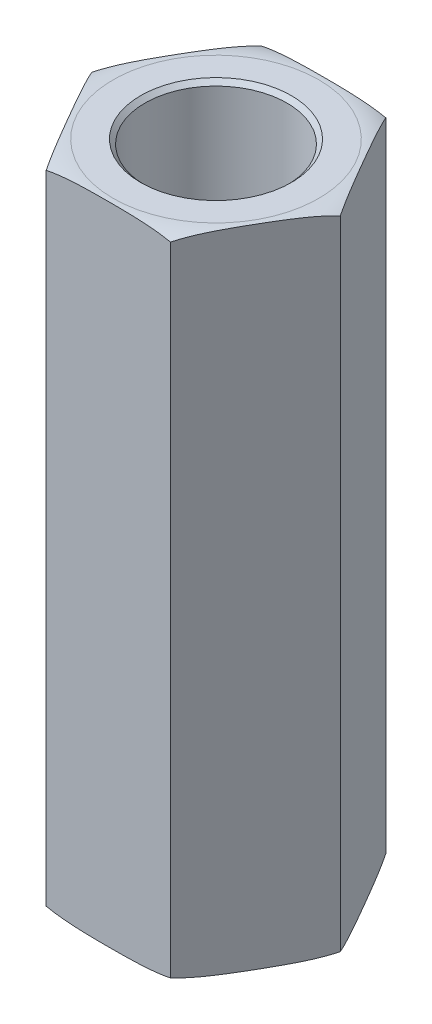
ISO-10303-21;
HEADER;
FILE_DESCRIPTION(('STEP AP214'),'2;1');
FILE_NAME('part.step','',(''),(''),'','','');
FILE_SCHEMA(('AUTOMOTIVE_DESIGN { 1 0 10303 214 1 1 1 1 }'));
ENDSEC;
DATA;
#1=APPLICATION_CONTEXT('core data for automotive mechanical design processes');
#2=APPLICATION_PROTOCOL_DEFINITION('international standard','automotive_design',2000,#1);
#3=PRODUCT_CONTEXT('',#1,'mechanical');
#4=PRODUCT('Part','Part','',(#3));
#5=PRODUCT_RELATED_PRODUCT_CATEGORY('part','',(#4));
#6=PRODUCT_DEFINITION_FORMATION('','',#4);
#7=PRODUCT_DEFINITION_CONTEXT('part definition',#1,'design');
#8=PRODUCT_DEFINITION('design','',#6,#7);
#9=PRODUCT_DEFINITION_SHAPE('','',#8);
#10=(LENGTH_UNIT() NAMED_UNIT(*) SI_UNIT(.MILLI.,.METRE.));
#11=(NAMED_UNIT(*) PLANE_ANGLE_UNIT() SI_UNIT($,.RADIAN.));
#12=(NAMED_UNIT(*) SI_UNIT($,.STERADIAN.) SOLID_ANGLE_UNIT());
#13=UNCERTAINTY_MEASURE_WITH_UNIT(LENGTH_MEASURE(1.E-05),#10,'distance_accuracy_value','');
#14=(GEOMETRIC_REPRESENTATION_CONTEXT(3) GLOBAL_UNCERTAINTY_ASSIGNED_CONTEXT((#13)) GLOBAL_UNIT_ASSIGNED_CONTEXT((#10,
#11,#12)) REPRESENTATION_CONTEXT('',''));
#15=CARTESIAN_POINT('',(0.,0.,0.));
#16=DIRECTION('',(0.,0.,1.));
#17=DIRECTION('',(1.,0.,0.));
#18=AXIS2_PLACEMENT_3D('',#15,#16,#17);
#19=CARTESIAN_POINT('',(3.66617420935412,9.525,0.));
#20=DIRECTION('',(-0.866025403784439,0.,0.5));
#21=DIRECTION('',(0.5,0.,0.866025403784439));
#22=AXIS2_PLACEMENT_3D('',#19,#20,#21);
#23=PLANE('',#22);
#24=DIRECTION('',(0.,1.,0.));
#25=VECTOR('',#24,1.);
#26=CARTESIAN_POINT('',(1.83308710467705,9.525,-3.175));
#27=LINE('',#26,#25);
#28=CARTESIAN_POINT('',(1.83308710467705,-9.398,-3.175));
#29=VERTEX_POINT('',#28);
#30=CARTESIAN_POINT('',(1.83308710467706,9.398,-3.175));
#31=VERTEX_POINT('',#30);
#32=EDGE_CURVE('E144',#29,#31,#27,.T.);
#33=ORIENTED_EDGE('',*,*,#32,.T.);
#34=CARTESIAN_POINT('',(3.66617420935412,9.398,0.));
#35=CARTESIAN_POINT('',(3.62797961467395,9.41390141489969,-0.0661549785605542));
#36=CARTESIAN_POINT('',(3.58956810864157,9.4274886076105,-0.132685658603869));
#37=CARTESIAN_POINT('',(3.51249051795711,9.45081619794021,-0.266187961794349));
#38=CARTESIAN_POINT('',(3.47382473049847,9.46056047713974,-0.333159070187379));
#39=CARTESIAN_POINT('',(3.39641631867874,9.4769966530451,-0.467234372392366));
#40=CARTESIAN_POINT('',(3.35767399633313,9.48369453286691,-0.534338043098168));
#41=CARTESIAN_POINT('',(3.28009834620114,9.4947767572932,-0.668703010556962));
#42=CARTESIAN_POINT('',(3.24126499587772,9.49916045047396,-0.735964346345247));
#43=CARTESIAN_POINT('',(3.16354065964316,9.50624030042628,-0.870586845688074));
#44=CARTESIAN_POINT('',(3.12464965374477,9.50893552375912,-0.937948043861543));
#45=CARTESIAN_POINT('',(3.04685144594594,9.51315319837134,-1.07269849250692));
#46=CARTESIAN_POINT('',(3.00794424351971,9.51467560802717,-1.14008774388952));
#47=CARTESIAN_POINT('',(2.93051517598875,9.51692270588903,-1.27419882283583));
#48=CARTESIAN_POINT('',(2.89199336248936,9.51765524681809,-1.34092056101645));
#49=CARTESIAN_POINT('',(2.81494778346146,9.51857673025742,-1.47436741839135));
#50=CARTESIAN_POINT('',(2.77642401791441,9.51876566589491,-1.5410925376177));
#51=CARTESIAN_POINT('',(2.69935964431015,9.51866599668056,-1.67457194815376));
#52=CARTESIAN_POINT('',(2.66081903631824,9.51837718117656,-1.74132623935034));
#53=CARTESIAN_POINT('',(2.58373908085332,9.517221986219,-1.87483263846072));
#54=CARTESIAN_POINT('',(2.54519973341248,9.51635559703857,-1.94158474631881));
#55=CARTESIAN_POINT('',(2.46812969629774,9.51378619406564,-2.07507396634277));
#56=CARTESIAN_POINT('',(2.42959900625968,9.51208322716166,-2.14181107913937));
#57=CARTESIAN_POINT('',(2.35255651340912,9.50743872297261,-2.27525259109831));
#58=CARTESIAN_POINT('',(2.31404470975446,9.50449724713581,-2.34195699171929));
#59=CARTESIAN_POINT('',(2.25084206239948,9.49821741247489,-2.45142718811098));
#60=CARTESIAN_POINT('',(2.22613849337013,9.49539801104633,-2.4942150247981));
#61=CARTESIAN_POINT('',(2.1767694527223,9.48886967943037,-2.57972471152106));
#62=CARTESIAN_POINT('',(2.15210397034186,9.48516108091391,-2.62244658019719));
#63=CARTESIAN_POINT('',(2.10282753811698,9.4766802711497,-2.70779586442641));
#64=CARTESIAN_POINT('',(2.07821657107531,9.47190846570085,-2.75042330976598));
#65=CARTESIAN_POINT('',(2.02900094683551,9.4610987712516,-2.83566727147553));
#66=CARTESIAN_POINT('',(2.00439646085464,9.45505773130843,-2.87828349128851));
#67=CARTESIAN_POINT('',(1.95527325900934,9.44151383541612,-2.96336737271503));
#68=CARTESIAN_POINT('',(1.93075459617615,9.43401019780297,-3.00583494247578));
#69=CARTESIAN_POINT('',(1.88182157373171,9.41732035070844,-3.09058942351744));
#70=CARTESIAN_POINT('',(1.85740744053269,9.40813149780328,-3.1328759426409));
#71=CARTESIAN_POINT('',(1.83308710467706,9.398,-3.175));
#72=B_SPLINE_CURVE_WITH_KNOTS('',3,(#34,#35,#36,#37,#38,#39,#40,#41,#42,#43,#44,#45,#46,#47,#48,
#49,#50,#51,#52,#53,#54,#55,#56,#57,#58,#59,#60,#61,#62,#63,#64,#65,#66,#67,#68,#69,#70,#71),
.UNSPECIFIED.,.F.,.F.,(4,2,2,2,2,2,2,2,2,2,2,2,2,2,2,2,2,2,4),(0.,0.233977307817935,
0.467717675040681,0.70099697355748,0.934341903229723,1.16781571967236,1.40129782179821,
1.63243665809665,1.86357841666612,2.09482211846288,2.32606971471488,2.5573043514739,
2.78852751694405,2.93698369265081,3.08538458004469,3.23372892334581,3.3824459854661,
3.53124274626083,3.68027493713586),.UNSPECIFIED.);
#73=CARTESIAN_POINT('',(3.66617420935412,9.398,0.));
#74=VERTEX_POINT('',#73);
#75=EDGE_CURVE('E96',#74,#31,#72,.T.);
#76=ORIENTED_EDGE('',*,*,#75,.F.);
#77=DIRECTION('',(0.,1.,0.));
#78=VECTOR('',#77,1.);
#79=CARTESIAN_POINT('',(3.66617420935412,9.525,0.));
#80=LINE('',#79,#78);
#81=CARTESIAN_POINT('',(3.66617420935412,-9.398,0.));
#82=VERTEX_POINT('',#81);
#83=EDGE_CURVE('E146',#74,#82,#80,.F.);
#84=ORIENTED_EDGE('',*,*,#83,.T.);
#85=CARTESIAN_POINT('',(1.83308710467705,-9.398,-3.17500000000001));
#86=CARTESIAN_POINT('',(1.87128169935722,-9.41390141489968,-3.10884502143945));
#87=CARTESIAN_POINT('',(1.9096932053896,-9.4274886076105,-3.04231434139614));
#88=CARTESIAN_POINT('',(1.98677079607406,-9.4508161979402,-2.90881203820566));
#89=CARTESIAN_POINT('',(2.0254365835327,-9.46056047713973,-2.84184092981263));
#90=CARTESIAN_POINT('',(2.10284499535243,-9.47699665304509,-2.70776562760765));
#91=CARTESIAN_POINT('',(2.14158731769803,-9.48369453286691,-2.64066195690184));
#92=CARTESIAN_POINT('',(2.21916296783002,-9.49477675729319,-2.50629698944305));
#93=CARTESIAN_POINT('',(2.25799631815344,-9.49916045047396,-2.43903565365477));
#94=CARTESIAN_POINT('',(2.335720654388,-9.50624030042628,-2.30441315431194));
#95=CARTESIAN_POINT('',(2.37461166028639,-9.50893552375912,-2.23705195613848));
#96=CARTESIAN_POINT('',(2.45240986808522,-9.51315319837134,-2.10230150749311));
#97=CARTESIAN_POINT('',(2.49131707051145,-9.51467560802717,-2.0349122561105));
#98=CARTESIAN_POINT('',(2.56874613804241,-9.51692270588903,-1.9008011771642));
#99=CARTESIAN_POINT('',(2.6072679515418,-9.51765524681809,-1.83407943898357));
#100=CARTESIAN_POINT('',(2.6843135305697,-9.51857673025742,-1.70063258160867));
#101=CARTESIAN_POINT('',(2.72283729611674,-9.51876566589491,-1.63390746238233));
#102=CARTESIAN_POINT('',(2.79990166972101,-9.51866599668056,-1.50042805184627));
#103=CARTESIAN_POINT('',(2.83844227771292,-9.51837718117656,-1.43367376064969));
#104=CARTESIAN_POINT('',(2.91552223317783,-9.517221986219,-1.30016736153931));
#105=CARTESIAN_POINT('',(2.95406158061867,-9.51635559703857,-1.23341525368122));
#106=CARTESIAN_POINT('',(3.03113161773342,-9.51378619406564,-1.09992603365727));
#107=CARTESIAN_POINT('',(3.06966230777147,-9.51208322716166,-1.03318892086067));
#108=CARTESIAN_POINT('',(3.14670480062203,-9.50743872297261,-0.899747408901733));
#109=CARTESIAN_POINT('',(3.18521660427669,-9.50449724713582,-0.83304300828075));
#110=CARTESIAN_POINT('',(3.24841925163167,-9.49821741247489,-0.723572811889063));
#111=CARTESIAN_POINT('',(3.27312282066102,-9.49539801104633,-0.680784975201942));
#112=CARTESIAN_POINT('',(3.32249186130885,-9.48886967943037,-0.595275288478971));
#113=CARTESIAN_POINT('',(3.3471573436893,-9.48516108091391,-0.552553419802841));
#114=CARTESIAN_POINT('',(3.39643377591418,-9.4766802711497,-0.46720413557362));
#115=CARTESIAN_POINT('',(3.42104474295585,-9.47190846570085,-0.424576690234039));
#116=CARTESIAN_POINT('',(3.47026036719565,-9.4610987712516,-0.339332728524487));
#117=CARTESIAN_POINT('',(3.49486485317652,-9.45505773130843,-0.296716508711511));
#118=CARTESIAN_POINT('',(3.54398805502183,-9.44151383541613,-0.211632627284978));
#119=CARTESIAN_POINT('',(3.56850671785502,-9.43401019780297,-0.169165057524231));
#120=CARTESIAN_POINT('',(3.61743974029946,-9.41732035070845,-0.08441057648256));
#121=CARTESIAN_POINT('',(3.64185387349848,-9.40813149780329,-0.0421240573591054));
#122=CARTESIAN_POINT('',(3.66617420935412,-9.398,0.));
#123=B_SPLINE_CURVE_WITH_KNOTS('',3,(#85,#86,#87,#88,#89,#90,#91,#92,#93,#94,#95,#96,#97,#98,
#99,#100,#101,#102,#103,#104,#105,#106,#107,#108,#109,#110,#111,#112,#113,#114,#115,#116,#117,
#118,#119,#120,#121,#122),.UNSPECIFIED.,.F.,.F.,(4,2,2,2,2,2,2,2,2,2,2,2,2,2,2,2,2,2,4),(0.,
0.233977307817932,0.467717675040674,0.700996973557469,0.934341903229708,1.16781571967234,
1.40129782179818,1.63243665809662,1.86357841666608,2.09482211846285,2.32606971471484,
2.55730435147386,2.78852751694401,2.93698369265077,3.08538458004466,3.23372892334579,
3.38244598546609,3.53124274626083,3.68027493713586),.UNSPECIFIED.);
#124=EDGE_CURVE('E224',#29,#82,#123,.T.);
#125=ORIENTED_EDGE('',*,*,#124,.F.);
#126=EDGE_LOOP('',(#33,#76,#84,#125));
#127=FACE_BOUND('',#126,.T.);
#128=ADVANCED_FACE('F16',(#127),#23,.F.);
#129=CARTESIAN_POINT('',(1.83308710467706,9.525,3.17499999999999));
#130=DIRECTION('',(-0.866025403784439,0.,-0.5));
#131=DIRECTION('',(-0.5,0.,0.866025403784439));
#132=AXIS2_PLACEMENT_3D('',#129,#130,#131);
#133=PLANE('',#132);
#134=ORIENTED_EDGE('',*,*,#83,.F.);
#135=CARTESIAN_POINT('',(1.83308710467706,9.398,3.17499999999999));
#136=CARTESIAN_POINT('',(1.87128169935724,9.41390141489969,3.10884502143943));
#137=CARTESIAN_POINT('',(1.90969320538961,9.4274886076105,3.04231434139612));
#138=CARTESIAN_POINT('',(1.98677079607407,9.45081619794021,2.90881203820564));
#139=CARTESIAN_POINT('',(2.02543658353271,9.46056047713974,2.84184092981261));
#140=CARTESIAN_POINT('',(2.10284499535245,9.4769966530451,2.70776562760762));
#141=CARTESIAN_POINT('',(2.14158731769805,9.48369453286691,2.64066195690182));
#142=CARTESIAN_POINT('',(2.21916296783004,9.4947767572932,2.50629698944302));
#143=CARTESIAN_POINT('',(2.25799631815346,9.49916045047396,2.43903565365474));
#144=CARTESIAN_POINT('',(2.33572065438802,9.50624030042628,2.30441315431191));
#145=CARTESIAN_POINT('',(2.37461166028641,9.50893552375912,2.23705195613844));
#146=CARTESIAN_POINT('',(2.45240986808524,9.51315319837134,2.10230150749307));
#147=CARTESIAN_POINT('',(2.49131707051148,9.51467560802717,2.03491225611046));
#148=CARTESIAN_POINT('',(2.56874613804244,9.51692270588903,1.90080117716416));
#149=CARTESIAN_POINT('',(2.60726795154182,9.51765524681809,1.83407943898353));
#150=CARTESIAN_POINT('',(2.68431353056973,9.51857673025742,1.70063258160863));
#151=CARTESIAN_POINT('',(2.72283729611677,9.51876566589491,1.63390746238228));
#152=CARTESIAN_POINT('',(2.79990166972104,9.51866599668056,1.50042805184622));
#153=CARTESIAN_POINT('',(2.83844227771295,9.51837718117656,1.43367376064964));
#154=CARTESIAN_POINT('',(2.91552223317786,9.517221986219,1.30016736153926));
#155=CARTESIAN_POINT('',(2.95406158061871,9.51635559703857,1.23341525368117));
#156=CARTESIAN_POINT('',(3.03113161773345,9.51378619406564,1.09992603365721));
#157=CARTESIAN_POINT('',(3.06966230777151,9.51208322716166,1.03318892086061));
#158=CARTESIAN_POINT('',(3.14670480062207,9.50743872297261,0.899747408901672));
#159=CARTESIAN_POINT('',(3.18521660427673,9.50449724713581,0.833043008280688));
#160=CARTESIAN_POINT('',(3.24841925163171,9.49821741247489,0.723572811889004));
#161=CARTESIAN_POINT('',(3.27312282066106,9.49539801104633,0.680784975201887));
#162=CARTESIAN_POINT('',(3.32249186130888,9.48886967943037,0.595275288478923));
#163=CARTESIAN_POINT('',(3.34715734368933,9.48516108091391,0.552553419802797));
#164=CARTESIAN_POINT('',(3.3964337759142,9.4766802711497,0.467204135573584));
#165=CARTESIAN_POINT('',(3.42104474295588,9.47190846570085,0.424576690234007));
#166=CARTESIAN_POINT('',(3.47026036719567,9.4610987712516,0.339332728524462));
#167=CARTESIAN_POINT('',(3.49486485317654,9.45505773130843,0.296716508711489));
#168=CARTESIAN_POINT('',(3.54398805502184,9.44151383541612,0.211632627284964));
#169=CARTESIAN_POINT('',(3.56850671785503,9.43401019780297,0.169165057524221));
#170=CARTESIAN_POINT('',(3.61743974029946,9.41732035070844,0.0844105764825579));
#171=CARTESIAN_POINT('',(3.64185387349848,9.40813149780328,0.042124057359107));
#172=CARTESIAN_POINT('',(3.66617420935412,9.398,0.));
#173=B_SPLINE_CURVE_WITH_KNOTS('',3,(#135,#136,#137,#138,#139,#140,#141,#142,#143,#144,#145,
#146,#147,#148,#149,#150,#151,#152,#153,#154,#155,#156,#157,#158,#159,#160,#161,#162,#163,#164,
#165,#166,#167,#168,#169,#170,#171,#172),.UNSPECIFIED.,.F.,.F.,(4,2,2,2,2,2,2,2,2,2,2,2,2,2,2,2,
2,2,4),(0.,0.233977307817936,0.467717675040682,0.700996973557482,0.934341903229727,
1.16781571967237,1.40129782179821,1.63243665809666,1.86357841666612,2.09482211846289,
2.32606971471489,2.55730435147391,2.78852751694406,2.93698369265081,3.08538458004469,
3.23372892334581,3.3824459854661,3.53124274626082,3.68027493713584),.UNSPECIFIED.);
#174=CARTESIAN_POINT('',(1.83308710467707,9.398,3.17499999999999));
#175=VERTEX_POINT('',#174);
#176=EDGE_CURVE('E217',#175,#74,#173,.T.);
#177=ORIENTED_EDGE('',*,*,#176,.F.);
#178=DIRECTION('',(0.,1.,0.));
#179=VECTOR('',#178,1.);
#180=CARTESIAN_POINT('',(1.83308710467707,9.525,3.17499999999999));
#181=LINE('',#180,#179);
#182=CARTESIAN_POINT('',(1.83308710467706,-9.398,3.17499999999999));
#183=VERTEX_POINT('',#182);
#184=EDGE_CURVE('E141',#175,#183,#181,.F.);
#185=ORIENTED_EDGE('',*,*,#184,.T.);
#186=CARTESIAN_POINT('',(3.66617420935412,-9.398,0.));
#187=CARTESIAN_POINT('',(3.62797961467395,-9.41390141489969,0.0661549785605599));
#188=CARTESIAN_POINT('',(3.58956810864157,-9.4274886076105,0.132685658603875));
#189=CARTESIAN_POINT('',(3.51249051795711,-9.45081619794021,0.266187961794355));
#190=CARTESIAN_POINT('',(3.47382473049847,-9.46056047713974,0.333159070187385));
#191=CARTESIAN_POINT('',(3.39641631867874,-9.4769966530451,0.467234372392373));
#192=CARTESIAN_POINT('',(3.35767399633313,-9.48369453286691,0.534338043098174));
#193=CARTESIAN_POINT('',(3.28009834620114,-9.4947767572932,0.668703010556968));
#194=CARTESIAN_POINT('',(3.24126499587772,-9.49916045047396,0.735964346345254));
#195=CARTESIAN_POINT('',(3.16354065964316,-9.50624030042628,0.87058684568808));
#196=CARTESIAN_POINT('',(3.12464965374477,-9.50893552375912,0.93794804386155));
#197=CARTESIAN_POINT('',(3.04685144594594,-9.51315319837134,1.07269849250692));
#198=CARTESIAN_POINT('',(3.00794424351971,-9.51467560802717,1.14008774388953));
#199=CARTESIAN_POINT('',(2.93051517598875,-9.51692270588903,1.27419882283583));
#200=CARTESIAN_POINT('',(2.89199336248936,-9.51765524681809,1.34092056101646));
#201=CARTESIAN_POINT('',(2.81494778346145,-9.51857673025742,1.47436741839136));
#202=CARTESIAN_POINT('',(2.77642401791441,-9.51876566589491,1.54109253761771));
#203=CARTESIAN_POINT('',(2.69935964431015,-9.51866599668056,1.67457194815377));
#204=CARTESIAN_POINT('',(2.66081903631824,-9.51837718117656,1.74132623935035));
#205=CARTESIAN_POINT('',(2.58373908085332,-9.517221986219,1.87483263846073));
#206=CARTESIAN_POINT('',(2.54519973341248,-9.51635559703857,1.94158474631882));
#207=CARTESIAN_POINT('',(2.46812969629773,-9.51378619406564,2.07507396634278));
#208=CARTESIAN_POINT('',(2.42959900625968,-9.51208322716166,2.14181107913938));
#209=CARTESIAN_POINT('',(2.35255651340911,-9.50743872297261,2.27525259109832));
#210=CARTESIAN_POINT('',(2.31404470975446,-9.50449724713581,2.3419569917193));
#211=CARTESIAN_POINT('',(2.25084206239948,-9.49821741247489,2.45142718811099));
#212=CARTESIAN_POINT('',(2.22613849337013,-9.49539801104633,2.4942150247981));
#213=CARTESIAN_POINT('',(2.1767694527223,-9.48886967943037,2.57972471152107));
#214=CARTESIAN_POINT('',(2.15210397034186,-9.48516108091391,2.62244658019719));
#215=CARTESIAN_POINT('',(2.10282753811698,-9.4766802711497,2.70779586442641));
#216=CARTESIAN_POINT('',(2.07821657107531,-9.47190846570085,2.75042330976598));
#217=CARTESIAN_POINT('',(2.02900094683551,-9.4610987712516,2.83566727147553));
#218=CARTESIAN_POINT('',(2.00439646085465,-9.45505773130843,2.8782834912885));
#219=CARTESIAN_POINT('',(1.95527325900934,-9.44151383541612,2.96336737271503));
#220=CARTESIAN_POINT('',(1.93075459617615,-9.43401019780296,3.00583494247577));
#221=CARTESIAN_POINT('',(1.88182157373172,-9.41732035070844,3.09058942351744));
#222=CARTESIAN_POINT('',(1.8574074405327,-9.40813149780329,3.13287594264089));
#223=CARTESIAN_POINT('',(1.83308710467706,-9.398,3.17499999999999));
#224=B_SPLINE_CURVE_WITH_KNOTS('',3,(#186,#187,#188,#189,#190,#191,#192,#193,#194,#195,#196,
#197,#198,#199,#200,#201,#202,#203,#204,#205,#206,#207,#208,#209,#210,#211,#212,#213,#214,#215,
#216,#217,#218,#219,#220,#221,#222,#223),.UNSPECIFIED.,.F.,.F.,(4,2,2,2,2,2,2,2,2,2,2,2,2,2,2,2,
2,2,4),(0.,0.233977307817936,0.467717675040682,0.700996973557481,0.934341903229725,
1.16781571967236,1.40129782179821,1.63243665809665,1.86357841666612,2.09482211846289,
2.32606971471488,2.55730435147391,2.78852751694405,2.93698369265081,3.08538458004468,
3.2337289233458,3.38244598546609,3.53124274626082,3.68027493713584),.UNSPECIFIED.);
#225=EDGE_CURVE('E246',#82,#183,#224,.T.);
#226=ORIENTED_EDGE('',*,*,#225,.F.);
#227=EDGE_LOOP('',(#134,#177,#185,#226));
#228=FACE_BOUND('',#227,.T.);
#229=ADVANCED_FACE('F221',(#228),#133,.F.);
#230=CARTESIAN_POINT('',(1.83308710467706,9.525,-3.175));
#231=DIRECTION('',(0.,0.,1.));
#232=DIRECTION('',(1.,0.,0.));
#233=AXIS2_PLACEMENT_3D('',#230,#231,#232);
#234=PLANE('',#233);
#235=DIRECTION('',(0.,1.,0.));
#236=VECTOR('',#235,1.);
#237=CARTESIAN_POINT('',(-1.83308710467707,9.525,-3.175));
#238=LINE('',#237,#236);
#239=CARTESIAN_POINT('',(-1.83308710467707,-9.39799999999999,-3.175));
#240=VERTEX_POINT('',#239);
#241=CARTESIAN_POINT('',(-1.83308710467706,9.398,-3.17500000000001));
#242=VERTEX_POINT('',#241);
#243=EDGE_CURVE('E103',#240,#242,#238,.T.);
#244=ORIENTED_EDGE('',*,*,#243,.T.);
#245=CARTESIAN_POINT('',(1.83308710467706,9.398,-3.175));
#246=CARTESIAN_POINT('',(1.73237579828683,9.41894001415179,-3.175));
#247=CARTESIAN_POINT('',(1.63096506893486,9.43588534953273,-3.175));
#248=CARTESIAN_POINT('',(1.42767146651469,9.46349716439842,-3.175));
#249=CARTESIAN_POINT('',(1.32579191427254,9.47418756587531,-3.175));
#250=CARTESIAN_POINT('',(1.12177634709137,9.49112804080793,-3.175));
#251=CARTESIAN_POINT('',(1.0196405664338,9.49738127071887,-3.175));
#252=CARTESIAN_POINT('',(0.815663681397375,9.50690280641833,-3.175));
#253=CARTESIAN_POINT('',(0.713823115514573,9.5101834044999,-3.175));
#254=CARTESIAN_POINT('',(0.510018485441651,9.51494548487028,-3.175));
#255=CARTESIAN_POINT('',(0.408054390577976,9.51642541008817,-3.175));
#256=CARTESIAN_POINT('',(0.20406020033787,9.51831468183793,-3.175));
#257=CARTESIAN_POINT('',(0.102030100168935,9.51872342414921,-3.175));
#258=CARTESIAN_POINT('',(-0.102030100168934,9.51872342414921,-3.175));
#259=CARTESIAN_POINT('',(-0.204060200337869,9.51831468183793,-3.175));
#260=CARTESIAN_POINT('',(-0.408054390577975,9.51642541008817,-3.175));
#261=CARTESIAN_POINT('',(-0.510018485441649,9.51494548487028,-3.175));
#262=CARTESIAN_POINT('',(-0.713823115514571,9.5101834044999,-3.175));
#263=CARTESIAN_POINT('',(-0.815663681397373,9.50690280641833,-3.175));
#264=CARTESIAN_POINT('',(-1.01964056643379,9.49738127071887,-3.175));
#265=CARTESIAN_POINT('',(-1.12177634709137,9.49112804080793,-3.175));
#266=CARTESIAN_POINT('',(-1.32579191427253,9.47418756587531,-3.175));
#267=CARTESIAN_POINT('',(-1.42767146651469,9.46349716439842,-3.175));
#268=CARTESIAN_POINT('',(-1.63096506893485,9.43588534953273,-3.175));
#269=CARTESIAN_POINT('',(-1.73237579828683,9.41894001415179,-3.175));
#270=CARTESIAN_POINT('',(-1.83308710467705,9.398,-3.17500000000001));
#271=B_SPLINE_CURVE_WITH_KNOTS('',3,(#245,#246,#247,#248,#249,#250,#251,#252,#253,#254,#255,
#256,#257,#258,#259,#260,#261,#262,#263,#264,#265,#266,#267,#268,#269,#270),.UNSPECIFIED.,.F.,
.F.,(4,2,2,2,2,2,2,2,2,2,2,2,4),(0.,0.308333242342807,0.615479423308234,0.922406891130008,
1.2280592962085,1.53397581645216,1.84006485747889,2.14615389850561,2.45207041874927,
2.75772282382776,3.06465029164954,3.37179647261496,3.68012971495777),.UNSPECIFIED.);
#272=EDGE_CURVE('E88',#31,#242,#271,.T.);
#273=ORIENTED_EDGE('',*,*,#272,.F.);
#274=ORIENTED_EDGE('',*,*,#32,.F.);
#275=CARTESIAN_POINT('',(-1.83308710467707,-9.39799999999999,-3.175));
#276=CARTESIAN_POINT('',(-1.73237579828684,-9.41894001415179,-3.175));
#277=CARTESIAN_POINT('',(-1.63096506893487,-9.43588534953273,-3.175));
#278=CARTESIAN_POINT('',(-1.4276714665147,-9.46349716439842,-3.175));
#279=CARTESIAN_POINT('',(-1.32579191427255,-9.47418756587531,-3.175));
#280=CARTESIAN_POINT('',(-1.12177634709138,-9.49112804080793,-3.175));
#281=CARTESIAN_POINT('',(-1.0196405664338,-9.49738127071887,-3.175));
#282=CARTESIAN_POINT('',(-0.81566368139738,-9.50690280641833,-3.175));
#283=CARTESIAN_POINT('',(-0.713823115514577,-9.5101834044999,-3.175));
#284=CARTESIAN_POINT('',(-0.510018485441654,-9.51494548487028,-3.175));
#285=CARTESIAN_POINT('',(-0.408054390577979,-9.51642541008817,-3.175));
#286=CARTESIAN_POINT('',(-0.204060200337872,-9.51831468183793,-3.175));
#287=CARTESIAN_POINT('',(-0.102030100168936,-9.51872342414921,-3.175));
#288=CARTESIAN_POINT('',(0.102030100168934,-9.51872342414921,-3.175));
#289=CARTESIAN_POINT('',(0.204060200337869,-9.51831468183793,-3.175));
#290=CARTESIAN_POINT('',(0.408054390577974,-9.51642541008817,-3.175));
#291=CARTESIAN_POINT('',(0.510018485441648,-9.51494548487028,-3.175));
#292=CARTESIAN_POINT('',(0.713823115514568,-9.5101834044999,-3.175));
#293=CARTESIAN_POINT('',(0.81566368139737,-9.50690280641833,-3.175));
#294=CARTESIAN_POINT('',(1.01964056643379,-9.49738127071887,-3.175));
#295=CARTESIAN_POINT('',(1.12177634709137,-9.49112804080794,-3.175));
#296=CARTESIAN_POINT('',(1.32579191427253,-9.47418756587531,-3.175));
#297=CARTESIAN_POINT('',(1.42767146651468,-9.46349716439843,-3.175));
#298=CARTESIAN_POINT('',(1.63096506893485,-9.43588534953273,-3.175));
#299=CARTESIAN_POINT('',(1.73237579828682,-9.41894001415179,-3.175));
#300=CARTESIAN_POINT('',(1.83308710467705,-9.398,-3.175));
#301=B_SPLINE_CURVE_WITH_KNOTS('',3,(#275,#276,#277,#278,#279,#280,#281,#282,#283,#284,#285,
#286,#287,#288,#289,#290,#291,#292,#293,#294,#295,#296,#297,#298,#299,#300),.UNSPECIFIED.,.F.,
.F.,(4,2,2,2,2,2,2,2,2,2,2,2,4),(0.,0.308333242342809,0.615479423308238,0.922406891130013,
1.22805929620851,1.53397581645217,1.8400648574789,2.14615389850562,2.45207041874928,
2.75772282382777,3.06465029164954,3.37179647261497,3.68012971495777),.UNSPECIFIED.);
#302=EDGE_CURVE('E105',#240,#29,#301,.T.);
#303=ORIENTED_EDGE('',*,*,#302,.F.);
#304=EDGE_LOOP('',(#244,#273,#274,#303));
#305=FACE_BOUND('',#304,.T.);
#306=ADVANCED_FACE('F104',(#305),#234,.F.);
#307=CARTESIAN_POINT('',(-1.83308710467707,9.525,3.175));
#308=DIRECTION('',(0.,0.,-1.));
#309=DIRECTION('',(-1.,0.,0.));
#310=AXIS2_PLACEMENT_3D('',#307,#308,#309);
#311=PLANE('',#310);
#312=ORIENTED_EDGE('',*,*,#184,.F.);
#313=CARTESIAN_POINT('',(-1.83308710467706,9.398,3.175));
#314=CARTESIAN_POINT('',(-1.73237579828684,9.41894001415179,3.175));
#315=CARTESIAN_POINT('',(-1.63096506893486,9.43588534953273,3.175));
#316=CARTESIAN_POINT('',(-1.42767146651469,9.46349716439843,3.175));
#317=CARTESIAN_POINT('',(-1.32579191427254,9.47418756587531,3.175));
#318=CARTESIAN_POINT('',(-1.12177634709138,9.49112804080793,3.175));
#319=CARTESIAN_POINT('',(-1.0196405664338,9.49738127071888,3.175));
#320=CARTESIAN_POINT('',(-0.815663681397378,9.50690280641833,3.175));
#321=CARTESIAN_POINT('',(-0.713823115514575,9.5101834044999,3.175));
#322=CARTESIAN_POINT('',(-0.510018485441652,9.51494548487029,3.175));
#323=CARTESIAN_POINT('',(-0.408054390577978,9.51642541008817,3.175));
#324=CARTESIAN_POINT('',(-0.204060200337871,9.51831468183793,3.175));
#325=CARTESIAN_POINT('',(-0.102030100168935,9.51872342414921,3.17499999999999));
#326=CARTESIAN_POINT('',(0.102030100168936,9.51872342414921,3.17499999999999));
#327=CARTESIAN_POINT('',(0.204060200337871,9.51831468183793,3.17499999999999));
#328=CARTESIAN_POINT('',(0.408054390577978,9.51642541008817,3.17499999999999));
#329=CARTESIAN_POINT('',(0.510018485441653,9.51494548487029,3.17499999999999));
#330=CARTESIAN_POINT('',(0.713823115514576,9.5101834044999,3.17499999999999));
#331=CARTESIAN_POINT('',(0.815663681397379,9.50690280641833,3.17499999999999));
#332=CARTESIAN_POINT('',(1.0196405664338,9.49738127071888,3.17499999999999));
#333=CARTESIAN_POINT('',(1.12177634709138,9.49112804080794,3.17499999999999));
#334=CARTESIAN_POINT('',(1.32579191427254,9.47418756587531,3.17499999999999));
#335=CARTESIAN_POINT('',(1.4276714665147,9.46349716439843,3.17499999999999));
#336=CARTESIAN_POINT('',(1.63096506893486,9.43588534953273,3.17499999999999));
#337=CARTESIAN_POINT('',(1.73237579828684,9.41894001415179,3.17499999999999));
#338=CARTESIAN_POINT('',(1.83308710467707,9.398,3.17499999999999));
#339=B_SPLINE_CURVE_WITH_KNOTS('',3,(#313,#314,#315,#316,#317,#318,#319,#320,#321,#322,#323,
#324,#325,#326,#327,#328,#329,#330,#331,#332,#333,#334,#335,#336,#337,#338),.UNSPECIFIED.,.F.,
.F.,(4,2,2,2,2,2,2,2,2,2,2,2,4),(0.,0.308333242342809,0.615479423308237,0.922406891130012,
1.2280592962085,1.53397581645216,1.84006485747889,2.14615389850562,2.45207041874928,
2.75772282382778,3.06465029164955,3.37179647261498,3.68012971495779),.UNSPECIFIED.);
#340=CARTESIAN_POINT('',(-1.83308710467707,9.398,3.175));
#341=VERTEX_POINT('',#340);
#342=EDGE_CURVE('E99',#341,#175,#339,.T.);
#343=ORIENTED_EDGE('',*,*,#342,.F.);
#344=DIRECTION('',(0.,1.,0.));
#345=VECTOR('',#344,1.);
#346=CARTESIAN_POINT('',(-1.83308710467707,9.525,3.175));
#347=LINE('',#346,#345);
#348=CARTESIAN_POINT('',(-1.83308710467706,-9.398,3.175));
#349=VERTEX_POINT('',#348);
#350=EDGE_CURVE('E107',#341,#349,#347,.F.);
#351=ORIENTED_EDGE('',*,*,#350,.T.);
#352=CARTESIAN_POINT('',(1.83308710467706,-9.398,3.17499999999999));
#353=CARTESIAN_POINT('',(1.73237579828684,-9.41894001415179,3.17499999999999));
#354=CARTESIAN_POINT('',(1.63096506893486,-9.43588534953273,3.17499999999999));
#355=CARTESIAN_POINT('',(1.4276714665147,-9.46349716439843,3.17499999999999));
#356=CARTESIAN_POINT('',(1.32579191427254,-9.47418756587531,3.17499999999999));
#357=CARTESIAN_POINT('',(1.12177634709138,-9.49112804080793,3.17499999999999));
#358=CARTESIAN_POINT('',(1.0196405664338,-9.49738127071888,3.17499999999999));
#359=CARTESIAN_POINT('',(0.815663681397379,-9.50690280641833,3.17499999999999));
#360=CARTESIAN_POINT('',(0.713823115514576,-9.5101834044999,3.17499999999999));
#361=CARTESIAN_POINT('',(0.510018485441653,-9.51494548487029,3.17499999999999));
#362=CARTESIAN_POINT('',(0.408054390577978,-9.51642541008817,3.17499999999999));
#363=CARTESIAN_POINT('',(0.204060200337871,-9.51831468183793,3.17499999999999));
#364=CARTESIAN_POINT('',(0.102030100168935,-9.51872342414921,3.17499999999999));
#365=CARTESIAN_POINT('',(-0.102030100168935,-9.51872342414921,3.17499999999999));
#366=CARTESIAN_POINT('',(-0.204060200337871,-9.51831468183793,3.175));
#367=CARTESIAN_POINT('',(-0.408054390577977,-9.51642541008817,3.175));
#368=CARTESIAN_POINT('',(-0.510018485441652,-9.51494548487029,3.175));
#369=CARTESIAN_POINT('',(-0.713823115514575,-9.5101834044999,3.175));
#370=CARTESIAN_POINT('',(-0.815663681397378,-9.50690280641833,3.175));
#371=CARTESIAN_POINT('',(-1.0196405664338,-9.49738127071888,3.175));
#372=CARTESIAN_POINT('',(-1.12177634709138,-9.49112804080793,3.175));
#373=CARTESIAN_POINT('',(-1.32579191427254,-9.47418756587531,3.175));
#374=CARTESIAN_POINT('',(-1.42767146651469,-9.46349716439843,3.175));
#375=CARTESIAN_POINT('',(-1.63096506893486,-9.43588534953273,3.175));
#376=CARTESIAN_POINT('',(-1.73237579828684,-9.41894001415179,3.175));
#377=CARTESIAN_POINT('',(-1.83308710467706,-9.398,3.175));
#378=B_SPLINE_CURVE_WITH_KNOTS('',3,(#352,#353,#354,#355,#356,#357,#358,#359,#360,#361,#362,
#363,#364,#365,#366,#367,#368,#369,#370,#371,#372,#373,#374,#375,#376,#377),.UNSPECIFIED.,.F.,
.F.,(4,2,2,2,2,2,2,2,2,2,2,2,4),(0.,0.308333242342809,0.615479423308237,0.922406891130013,
1.22805929620851,1.53397581645217,1.84006485747889,2.14615389850562,2.45207041874928,
2.75772282382778,3.06465029164955,3.37179647261498,3.68012971495779),.UNSPECIFIED.);
#379=EDGE_CURVE('E211',#183,#349,#378,.T.);
#380=ORIENTED_EDGE('',*,*,#379,.F.);
#381=EDGE_LOOP('',(#312,#343,#351,#380));
#382=FACE_BOUND('',#381,.T.);
#383=ADVANCED_FACE('F379',(#382),#311,.F.);
#384=CARTESIAN_POINT('',(-3.66617420935413,9.525,0.));
#385=DIRECTION('',(0.866025403784439,0.,-0.499999999999999));
#386=DIRECTION('',(-0.499999999999999,0.,-0.866025403784439));
#387=AXIS2_PLACEMENT_3D('',#384,#385,#386);
#388=PLANE('',#387);
#389=ORIENTED_EDGE('',*,*,#350,.F.);
#390=CARTESIAN_POINT('',(-3.66617420935412,9.398,0.));
#391=CARTESIAN_POINT('',(-3.62797961467395,9.41390141489969,0.0661549785605627));
#392=CARTESIAN_POINT('',(-3.58956810864157,9.4274886076105,0.132685658603878));
#393=CARTESIAN_POINT('',(-3.51249051795711,9.4508161979402,0.266187961794359));
#394=CARTESIAN_POINT('',(-3.47382473049847,9.46056047713974,0.333159070187389));
#395=CARTESIAN_POINT('',(-3.39641631867874,9.47699665304509,0.467234372392377));
#396=CARTESIAN_POINT('',(-3.35767399633313,9.48369453286691,0.534338043098178));
#397=CARTESIAN_POINT('',(-3.28009834620114,9.49477675729319,0.668703010556972));
#398=CARTESIAN_POINT('',(-3.24126499587772,9.49916045047396,0.735964346345258));
#399=CARTESIAN_POINT('',(-3.16354065964316,9.50624030042628,0.870586845688085));
#400=CARTESIAN_POINT('',(-3.12464965374477,9.50893552375912,0.937948043861555));
#401=CARTESIAN_POINT('',(-3.04685144594594,9.51315319837134,1.07269849250693));
#402=CARTESIAN_POINT('',(-3.00794424351971,9.51467560802717,1.14008774388953));
#403=CARTESIAN_POINT('',(-2.93051517598875,9.51692270588903,1.27419882283584));
#404=CARTESIAN_POINT('',(-2.89199336248936,9.51765524681809,1.34092056101647));
#405=CARTESIAN_POINT('',(-2.81494778346146,9.51857673025742,1.47436741839137));
#406=CARTESIAN_POINT('',(-2.77642401791441,9.5187656658949,1.54109253761772));
#407=CARTESIAN_POINT('',(-2.69935964431015,9.51866599668056,1.67457194815378));
#408=CARTESIAN_POINT('',(-2.66081903631824,9.51837718117656,1.74132623935036));
#409=CARTESIAN_POINT('',(-2.58373908085332,9.517221986219,1.87483263846074));
#410=CARTESIAN_POINT('',(-2.54519973341248,9.51635559703857,1.94158474631883));
#411=CARTESIAN_POINT('',(-2.46812969629774,9.51378619406564,2.07507396634279));
#412=CARTESIAN_POINT('',(-2.42959900625968,9.51208322716166,2.14181107913938));
#413=CARTESIAN_POINT('',(-2.35255651340912,9.50743872297261,2.27525259109832));
#414=CARTESIAN_POINT('',(-2.31404470975446,9.50449724713581,2.34195699171931));
#415=CARTESIAN_POINT('',(-2.25084206239948,9.49821741247489,2.45142718811099));
#416=CARTESIAN_POINT('',(-2.22613849337013,9.49539801104632,2.49421502479811));
#417=CARTESIAN_POINT('',(-2.17676945272231,9.48886967943037,2.57972471152108));
#418=CARTESIAN_POINT('',(-2.15210397034186,9.48516108091391,2.6224465801972));
#419=CARTESIAN_POINT('',(-2.10282753811698,9.47668027114969,2.70779586442642));
#420=CARTESIAN_POINT('',(-2.07821657107531,9.47190846570085,2.75042330976599));
#421=CARTESIAN_POINT('',(-2.02900094683551,9.4610987712516,2.83566727147554));
#422=CARTESIAN_POINT('',(-2.00439646085465,9.45505773130842,2.87828349128851));
#423=CARTESIAN_POINT('',(-1.95527325900935,9.44151383541612,2.96336737271504));
#424=CARTESIAN_POINT('',(-1.93075459617615,9.43401019780296,3.00583494247578));
#425=CARTESIAN_POINT('',(-1.88182157373172,9.41732035070844,3.09058942351745));
#426=CARTESIAN_POINT('',(-1.8574074405327,9.40813149780328,3.1328759426409));
#427=CARTESIAN_POINT('',(-1.83308710467707,9.398,3.175));
#428=B_SPLINE_CURVE_WITH_KNOTS('',3,(#390,#391,#392,#393,#394,#395,#396,#397,#398,#399,#400,
#401,#402,#403,#404,#405,#406,#407,#408,#409,#410,#411,#412,#413,#414,#415,#416,#417,#418,#419,
#420,#421,#422,#423,#424,#425,#426,#427),.UNSPECIFIED.,.F.,.F.,(4,2,2,2,2,2,2,2,2,2,2,2,2,2,2,2,
2,2,4),(0.,0.233977307817936,0.467717675040682,0.700996973557482,0.934341903229725,
1.16781571967237,1.40129782179821,1.63243665809665,1.86357841666612,2.09482211846289,
2.32606971471489,2.55730435147391,2.78852751694406,2.93698369265081,3.08538458004469,
3.23372892334581,3.3824459854661,3.53124274626082,3.68027493713584),.UNSPECIFIED.);
#429=CARTESIAN_POINT('',(-3.66617420935413,9.398,0.));
#430=VERTEX_POINT('',#429);
#431=EDGE_CURVE('E100',#430,#341,#428,.T.);
#432=ORIENTED_EDGE('',*,*,#431,.F.);
#433=DIRECTION('',(0.,1.,0.));
#434=VECTOR('',#433,1.);
#435=CARTESIAN_POINT('',(-3.66617420935413,9.525,0.));
#436=LINE('',#435,#434);
#437=CARTESIAN_POINT('',(-3.66617420935412,-9.398,0.));
#438=VERTEX_POINT('',#437);
#439=EDGE_CURVE('E82',#430,#438,#436,.F.);
#440=ORIENTED_EDGE('',*,*,#439,.T.);
#441=CARTESIAN_POINT('',(-1.83308710467707,-9.398,3.175));
#442=CARTESIAN_POINT('',(-1.87128169935724,-9.41390141489968,3.10884502143945));
#443=CARTESIAN_POINT('',(-1.90969320538961,-9.4274886076105,3.04231434139613));
#444=CARTESIAN_POINT('',(-1.98677079607407,-9.4508161979402,2.90881203820565));
#445=CARTESIAN_POINT('',(-2.02543658353271,-9.46056047713973,2.84184092981263));
#446=CARTESIAN_POINT('',(-2.10284499535244,-9.47699665304509,2.70776562760764));
#447=CARTESIAN_POINT('',(-2.14158731769805,-9.48369453286691,2.64066195690184));
#448=CARTESIAN_POINT('',(-2.21916296783004,-9.49477675729319,2.50629698944305));
#449=CARTESIAN_POINT('',(-2.25799631815346,-9.49916045047396,2.43903565365476));
#450=CARTESIAN_POINT('',(-2.33572065438802,-9.50624030042628,2.30441315431194));
#451=CARTESIAN_POINT('',(-2.3746116602864,-9.50893552375912,2.23705195613847));
#452=CARTESIAN_POINT('',(-2.45240986808523,-9.51315319837134,2.1023015074931));
#453=CARTESIAN_POINT('',(-2.49131707051146,-9.51467560802717,2.0349122561105));
#454=CARTESIAN_POINT('',(-2.56874613804242,-9.51692270588903,1.90080117716419));
#455=CARTESIAN_POINT('',(-2.60726795154181,-9.51765524681809,1.83407943898357));
#456=CARTESIAN_POINT('',(-2.68431353056971,-9.51857673025742,1.70063258160867));
#457=CARTESIAN_POINT('',(-2.72283729611675,-9.51876566589491,1.63390746238232));
#458=CARTESIAN_POINT('',(-2.79990166972102,-9.51866599668056,1.50042805184626));
#459=CARTESIAN_POINT('',(-2.83844227771293,-9.51837718117656,1.43367376064968));
#460=CARTESIAN_POINT('',(-2.91552223317784,-9.517221986219,1.30016736153931));
#461=CARTESIAN_POINT('',(-2.95406158061869,-9.51635559703857,1.23341525368122));
#462=CARTESIAN_POINT('',(-3.03113161773343,-9.51378619406564,1.09992603365726));
#463=CARTESIAN_POINT('',(-3.06966230777148,-9.51208322716166,1.03318892086066));
#464=CARTESIAN_POINT('',(-3.14670480062204,-9.50743872297261,0.899747408901727));
#465=CARTESIAN_POINT('',(-3.1852166042767,-9.50449724713581,0.833043008280744));
#466=CARTESIAN_POINT('',(-3.24841925163168,-9.49821741247489,0.723572811889058));
#467=CARTESIAN_POINT('',(-3.27312282066103,-9.49539801104633,0.680784975201938));
#468=CARTESIAN_POINT('',(-3.32249186130886,-9.48886967943037,0.595275288478968));
#469=CARTESIAN_POINT('',(-3.34715734368931,-9.48516108091391,0.552553419802839));
#470=CARTESIAN_POINT('',(-3.39643377591419,-9.4766802711497,0.46720413557362));
#471=CARTESIAN_POINT('',(-3.42104474295586,-9.47190846570085,0.42457669023404));
#472=CARTESIAN_POINT('',(-3.47026036719566,-9.4610987712516,0.339332728524489));
#473=CARTESIAN_POINT('',(-3.49486485317653,-9.45505773130843,0.296716508711513));
#474=CARTESIAN_POINT('',(-3.54398805502183,-9.44151383541613,0.211632627284982));
#475=CARTESIAN_POINT('',(-3.56850671785503,-9.43401019780297,0.169165057524236));
#476=CARTESIAN_POINT('',(-3.61743974029946,-9.41732035070845,0.0844105764825669));
#477=CARTESIAN_POINT('',(-3.64185387349848,-9.40813149780329,0.042124057359113));
#478=CARTESIAN_POINT('',(-3.66617420935412,-9.398,0.));
#479=B_SPLINE_CURVE_WITH_KNOTS('',3,(#441,#442,#443,#444,#445,#446,#447,#448,#449,#450,#451,
#452,#453,#454,#455,#456,#457,#458,#459,#460,#461,#462,#463,#464,#465,#466,#467,#468,#469,#470,
#471,#472,#473,#474,#475,#476,#477,#478),.UNSPECIFIED.,.F.,.F.,(4,2,2,2,2,2,2,2,2,2,2,2,2,2,2,2,
2,2,4),(0.,0.233977307817931,0.467717675040673,0.700996973557468,0.934341903229707,
1.16781571967234,1.40129782179818,1.63243665809662,1.86357841666608,2.09482211846285,
2.32606971471484,2.55730435147386,2.788527516944,2.93698369265077,3.08538458004465,
3.23372892334578,3.38244598546608,3.53124274626081,3.68027493713584),.UNSPECIFIED.);
#480=EDGE_CURVE('E164',#349,#438,#479,.T.);
#481=ORIENTED_EDGE('',*,*,#480,.F.);
#482=EDGE_LOOP('',(#389,#432,#440,#481));
#483=FACE_BOUND('',#482,.T.);
#484=ADVANCED_FACE('F214',(#483),#388,.F.);
#485=CARTESIAN_POINT('',(-1.83308710467707,9.525,-3.175));
#486=DIRECTION('',(0.866025403784439,0.,0.5));
#487=DIRECTION('',(0.5,0.,-0.866025403784439));
#488=AXIS2_PLACEMENT_3D('',#485,#486,#487);
#489=PLANE('',#488);
#490=ORIENTED_EDGE('',*,*,#439,.F.);
#491=CARTESIAN_POINT('',(-1.83308710467706,9.39799999999999,-3.17500000000001));
#492=CARTESIAN_POINT('',(-1.87128169935723,9.41390141489968,-3.10884502143945));
#493=CARTESIAN_POINT('',(-1.90969320538961,9.42748860761049,-3.04231434139614));
#494=CARTESIAN_POINT('',(-1.98677079607407,9.4508161979402,-2.90881203820567));
#495=CARTESIAN_POINT('',(-2.02543658353271,9.46056047713973,-2.84184092981264));
#496=CARTESIAN_POINT('',(-2.10284499535244,9.47699665304509,-2.70776562760765));
#497=CARTESIAN_POINT('',(-2.14158731769804,9.48369453286691,-2.64066195690185));
#498=CARTESIAN_POINT('',(-2.21916296783003,9.49477675729319,-2.50629698944306));
#499=CARTESIAN_POINT('',(-2.25799631815345,9.49916045047396,-2.43903565365478));
#500=CARTESIAN_POINT('',(-2.33572065438801,9.50624030042628,-2.30441315431196));
#501=CARTESIAN_POINT('',(-2.3746116602864,9.50893552375912,-2.23705195613849));
#502=CARTESIAN_POINT('',(-2.45240986808522,9.51315319837134,-2.10230150749312));
#503=CARTESIAN_POINT('',(-2.49131707051146,9.51467560802717,-2.03491225611052));
#504=CARTESIAN_POINT('',(-2.56874613804241,9.51692270588903,-1.90080117716422));
#505=CARTESIAN_POINT('',(-2.6072679515418,9.51765524681809,-1.83407943898359));
#506=CARTESIAN_POINT('',(-2.6843135305697,9.51857673025742,-1.70063258160869));
#507=CARTESIAN_POINT('',(-2.72283729611674,9.5187656658949,-1.63390746238234));
#508=CARTESIAN_POINT('',(-2.79990166972101,9.51866599668056,-1.50042805184629));
#509=CARTESIAN_POINT('',(-2.83844227771292,9.51837718117656,-1.43367376064971));
#510=CARTESIAN_POINT('',(-2.91552223317783,9.517221986219,-1.30016736153933));
#511=CARTESIAN_POINT('',(-2.95406158061867,9.51635559703857,-1.23341525368124));
#512=CARTESIAN_POINT('',(-3.03113161773341,9.51378619406564,-1.09992603365729));
#513=CARTESIAN_POINT('',(-3.06966230777147,9.51208322716166,-1.03318892086069));
#514=CARTESIAN_POINT('',(-3.14670480062203,9.50743872297261,-0.899747408901758));
#515=CARTESIAN_POINT('',(-3.18521660427669,9.50449724713581,-0.833043008280777));
#516=CARTESIAN_POINT('',(-3.24841925163167,9.49821741247489,-0.723572811889089));
#517=CARTESIAN_POINT('',(-3.27312282066102,9.49539801104633,-0.680784975201966));
#518=CARTESIAN_POINT('',(-3.32249186130885,9.48886967943037,-0.595275288478991));
#519=CARTESIAN_POINT('',(-3.3471573436893,9.48516108091391,-0.552553419802859));
#520=CARTESIAN_POINT('',(-3.39643377591418,9.4766802711497,-0.467204135573636));
#521=CARTESIAN_POINT('',(-3.42104474295586,9.47190846570085,-0.424576690234054));
#522=CARTESIAN_POINT('',(-3.47026036719566,9.4610987712516,-0.339332728524499));
#523=CARTESIAN_POINT('',(-3.49486485317653,9.45505773130843,-0.29671650871152));
#524=CARTESIAN_POINT('',(-3.54398805502183,9.44151383541612,-0.211632627284985));
#525=CARTESIAN_POINT('',(-3.56850671785503,9.43401019780296,-0.169165057524237));
#526=CARTESIAN_POINT('',(-3.61743974029947,9.41732035070844,-0.0844105764825633));
#527=CARTESIAN_POINT('',(-3.64185387349849,9.40813149780328,-0.0421240573591073));
#528=CARTESIAN_POINT('',(-3.66617420935413,9.39799999999999,0.));
#529=B_SPLINE_CURVE_WITH_KNOTS('',3,(#491,#492,#493,#494,#495,#496,#497,#498,#499,#500,#501,
#502,#503,#504,#505,#506,#507,#508,#509,#510,#511,#512,#513,#514,#515,#516,#517,#518,#519,#520,
#521,#522,#523,#524,#525,#526,#527,#528),.UNSPECIFIED.,.F.,.F.,(4,2,2,2,2,2,2,2,2,2,2,2,2,2,2,2,
2,2,4),(0.,0.233977307817929,0.467717675040669,0.700996973557462,0.9343419032297,
1.16781571967233,1.40129782179817,1.63243665809661,1.86357841666607,2.09482211846283,
2.32606971471482,2.55730435147384,2.78852751694398,2.93698369265075,3.08538458004464,
3.23372892334578,3.38244598546609,3.53124274626083,3.68027493713587),.UNSPECIFIED.);
#530=EDGE_CURVE('E93',#242,#430,#529,.T.);
#531=ORIENTED_EDGE('',*,*,#530,.F.);
#532=ORIENTED_EDGE('',*,*,#243,.F.);
#533=CARTESIAN_POINT('',(-3.66617420935413,-9.39799999999999,0.));
#534=CARTESIAN_POINT('',(-3.62797961467396,-9.41390141489968,-0.0661549785605546));
#535=CARTESIAN_POINT('',(-3.58956810864158,-9.42748860761049,-0.132685658603869));
#536=CARTESIAN_POINT('',(-3.51249051795712,-9.4508161979402,-0.266187961794347));
#537=CARTESIAN_POINT('',(-3.47382473049848,-9.46056047713973,-0.333159070187375));
#538=CARTESIAN_POINT('',(-3.39641631867875,-9.47699665304509,-0.467234372392361));
#539=CARTESIAN_POINT('',(-3.35767399633315,-9.48369453286691,-0.534338043098161));
#540=CARTESIAN_POINT('',(-3.28009834620116,-9.49477675729319,-0.668703010556952));
#541=CARTESIAN_POINT('',(-3.24126499587774,-9.49916045047396,-0.735964346345237));
#542=CARTESIAN_POINT('',(-3.16354065964318,-9.50624030042628,-0.870586845688061));
#543=CARTESIAN_POINT('',(-3.12464965374479,-9.50893552375912,-0.937948043861529));
#544=CARTESIAN_POINT('',(-3.04685144594596,-9.51315319837134,-1.0726984925069));
#545=CARTESIAN_POINT('',(-3.00794424351973,-9.51467560802717,-1.1400877438895));
#546=CARTESIAN_POINT('',(-2.93051517598877,-9.51692270588903,-1.27419882283581));
#547=CARTESIAN_POINT('',(-2.89199336248939,-9.51765524681809,-1.34092056101643));
#548=CARTESIAN_POINT('',(-2.81494778346148,-9.51857673025742,-1.47436741839133));
#549=CARTESIAN_POINT('',(-2.77642401791444,-9.5187656658949,-1.54109253761768));
#550=CARTESIAN_POINT('',(-2.69935964431017,-9.51866599668056,-1.67457194815373));
#551=CARTESIAN_POINT('',(-2.66081903631827,-9.51837718117656,-1.74132623935032));
#552=CARTESIAN_POINT('',(-2.58373908085335,-9.517221986219,-1.87483263846069));
#553=CARTESIAN_POINT('',(-2.54519973341251,-9.51635559703857,-1.94158474631878));
#554=CARTESIAN_POINT('',(-2.46812969629777,-9.51378619406564,-2.07507396634274));
#555=CARTESIAN_POINT('',(-2.42959900625971,-9.51208322716166,-2.14181107913933));
#556=CARTESIAN_POINT('',(-2.35255651340915,-9.50743872297261,-2.27525259109827));
#557=CARTESIAN_POINT('',(-2.31404470975449,-9.50449724713581,-2.34195699171925));
#558=CARTESIAN_POINT('',(-2.25084206239951,-9.49821741247489,-2.45142718811094));
#559=CARTESIAN_POINT('',(-2.22613849337016,-9.49539801104633,-2.49421502479806));
#560=CARTESIAN_POINT('',(-2.17676945272233,-9.48886967943037,-2.57972471152103));
#561=CARTESIAN_POINT('',(-2.15210397034188,-9.48516108091391,-2.62244658019716));
#562=CARTESIAN_POINT('',(-2.102827538117,-9.4766802711497,-2.70779586442638));
#563=CARTESIAN_POINT('',(-2.07821657107533,-9.47190846570085,-2.75042330976596));
#564=CARTESIAN_POINT('',(-2.02900094683553,-9.4610987712516,-2.83566727147552));
#565=CARTESIAN_POINT('',(-2.00439646085466,-9.45505773130843,-2.87828349128849));
#566=CARTESIAN_POINT('',(-1.95527325900936,-9.44151383541612,-2.96336737271502));
#567=CARTESIAN_POINT('',(-1.93075459617616,-9.43401019780296,-3.00583494247577));
#568=CARTESIAN_POINT('',(-1.88182157373173,-9.41732035070844,-3.09058942351744));
#569=CARTESIAN_POINT('',(-1.85740744053271,-9.40813149780328,-3.1328759426409));
#570=CARTESIAN_POINT('',(-1.83308710467707,-9.39799999999999,-3.175));
#571=B_SPLINE_CURVE_WITH_KNOTS('',3,(#533,#534,#535,#536,#537,#538,#539,#540,#541,#542,#543,
#544,#545,#546,#547,#548,#549,#550,#551,#552,#553,#554,#555,#556,#557,#558,#559,#560,#561,#562,
#563,#564,#565,#566,#567,#568,#569,#570),.UNSPECIFIED.,.F.,.F.,(4,2,2,2,2,2,2,2,2,2,2,2,2,2,2,2,
2,2,4),(0.,0.233977307817932,0.467717675040674,0.700996973557469,0.934341903229708,
1.16781571967234,1.40129782179818,1.63243665809662,1.86357841666608,2.09482211846285,
2.32606971471484,2.55730435147386,2.788527516944,2.93698369265077,3.08538458004465,
3.23372892334579,3.38244598546609,3.53124274626082,3.68027493713586),.UNSPECIFIED.);
#572=EDGE_CURVE('E156',#438,#240,#571,.T.);
#573=ORIENTED_EDGE('',*,*,#572,.F.);
#574=EDGE_LOOP('',(#490,#531,#532,#573));
#575=FACE_BOUND('',#574,.T.);
#576=ADVANCED_FACE('F109',(#575),#489,.F.);
#577=CARTESIAN_POINT('',(0.,7.87400000000007,0.));
#578=DIRECTION('',(0.,1.,0.));
#579=DIRECTION('',(0.,0.,1.));
#580=AXIS2_PLACEMENT_3D('',#577,#578,#579);
#581=TOROIDAL_SURFACE('',#580,3.03117420935413,1.65099999999993);
#582=CARTESIAN_POINT('',(0.,9.525,0.));
#583=DIRECTION('',(0.,-1.,0.));
#584=DIRECTION('',(0.,0.,1.));
#585=AXIS2_PLACEMENT_3D('',#582,#583,#584);
#586=CIRCLE('',#585,3.03117420935412);
#587=CARTESIAN_POINT('',(0.,9.525,3.03117420935412));
#588=VERTEX_POINT('',#587);
#589=CARTESIAN_POINT('',(0.,9.525,-3.03117420935412));
#590=VERTEX_POINT('',#589);
#591=EDGE_CURVE('E163',#588,#590,#586,.T.);
#592=ORIENTED_EDGE('',*,*,#591,.T.);
#593=CARTESIAN_POINT('',(0.,9.525,0.));
#594=DIRECTION('',(0.,-1.,0.));
#595=DIRECTION('',(0.,0.,-1.));
#596=AXIS2_PLACEMENT_3D('',#593,#594,#595);
#597=CIRCLE('',#596,3.03117420935412);
#598=EDGE_CURVE('E200',#590,#588,#597,.T.);
#599=ORIENTED_EDGE('',*,*,#598,.T.);
#600=EDGE_LOOP('',(#592,#599));
#601=FACE_BOUND('',#600,.T.);
#602=ORIENTED_EDGE('',*,*,#176,.T.);
#603=ORIENTED_EDGE('',*,*,#75,.T.);
#604=ORIENTED_EDGE('',*,*,#272,.T.);
#605=ORIENTED_EDGE('',*,*,#530,.T.);
#606=ORIENTED_EDGE('',*,*,#431,.T.);
#607=ORIENTED_EDGE('',*,*,#342,.T.);
#608=EDGE_LOOP('',(#602,#603,#604,#605,#606,#607));
#609=FACE_BOUND('',#608,.T.);
#610=ADVANCED_FACE('F91',(#601,#609),#581,.T.);
#611=CARTESIAN_POINT('',(0.,-7.87400000000007,0.));
#612=DIRECTION('',(0.,-1.,0.));
#613=DIRECTION('',(0.,0.,1.));
#614=AXIS2_PLACEMENT_3D('',#611,#612,#613);
#615=TOROIDAL_SURFACE('',#614,3.03117420935413,1.65099999999993);
#616=CARTESIAN_POINT('',(0.,-9.525,0.));
#617=DIRECTION('',(0.,1.,0.));
#618=DIRECTION('',(0.,0.,1.));
#619=AXIS2_PLACEMENT_3D('',#616,#617,#618);
#620=CIRCLE('',#619,3.03117420935412);
#621=CARTESIAN_POINT('',(0.,-9.525,-3.03117420935412));
#622=VERTEX_POINT('',#621);
#623=CARTESIAN_POINT('',(0.,-9.525,3.03117420935412));
#624=VERTEX_POINT('',#623);
#625=EDGE_CURVE('E36',#622,#624,#620,.F.);
#626=ORIENTED_EDGE('',*,*,#625,.F.);
#627=CARTESIAN_POINT('',(0.,-9.525,0.));
#628=DIRECTION('',(0.,1.,0.));
#629=DIRECTION('',(0.,0.,-1.));
#630=AXIS2_PLACEMENT_3D('',#627,#628,#629);
#631=CIRCLE('',#630,3.03117420935412);
#632=EDGE_CURVE('E155',#624,#622,#631,.F.);
#633=ORIENTED_EDGE('',*,*,#632,.F.);
#634=EDGE_LOOP('',(#626,#633));
#635=FACE_BOUND('',#634,.T.);
#636=ORIENTED_EDGE('',*,*,#480,.T.);
#637=ORIENTED_EDGE('',*,*,#572,.T.);
#638=ORIENTED_EDGE('',*,*,#302,.T.);
#639=ORIENTED_EDGE('',*,*,#124,.T.);
#640=ORIENTED_EDGE('',*,*,#225,.T.);
#641=ORIENTED_EDGE('',*,*,#379,.T.);
#642=EDGE_LOOP('',(#636,#637,#638,#639,#640,#641));
#643=FACE_BOUND('',#642,.T.);
#644=ADVANCED_FACE('F170',(#635,#643),#615,.T.);
#645=CARTESIAN_POINT('',(-1.83308710467707,9.525,-3.175));
#646=DIRECTION('',(0.,-1.,0.));
#647=DIRECTION('',(0.,0.,-1.));
#648=AXIS2_PLACEMENT_3D('',#645,#646,#647);
#649=PLANE('',#648);
#650=ORIENTED_EDGE('',*,*,#591,.F.);
#651=ORIENTED_EDGE('',*,*,#598,.F.);
#652=EDGE_LOOP('',(#650,#651));
#653=FACE_BOUND('',#652,.T.);
#654=CARTESIAN_POINT('',(0.,9.52499999993961,0.));
#655=DIRECTION('',(0.,1.,0.));
#656=DIRECTION('',(0.,0.,1.));
#657=AXIS2_PLACEMENT_3D('',#654,#655,#656);
#658=CIRCLE('',#657,2.22250000001623);
#659=CARTESIAN_POINT('',(0.,9.52499999993961,2.22250000001623));
#660=VERTEX_POINT('',#659);
#661=EDGE_CURVE('E152',#660,#660,#658,.F.);
#662=ORIENTED_EDGE('',*,*,#661,.T.);
#663=EDGE_LOOP('',(#662));
#664=FACE_BOUND('',#663,.T.);
#665=ADVANCED_FACE('F175',(#653,#664),#649,.F.);
#666=CARTESIAN_POINT('',(-1.83308710467707,-9.525,-3.175));
#667=DIRECTION('',(0.,-1.,0.));
#668=DIRECTION('',(0.,0.,-1.));
#669=AXIS2_PLACEMENT_3D('',#666,#667,#668);
#670=PLANE('',#669);
#671=ORIENTED_EDGE('',*,*,#625,.T.);
#672=ORIENTED_EDGE('',*,*,#632,.T.);
#673=EDGE_LOOP('',(#671,#672));
#674=FACE_BOUND('',#673,.T.);
#675=CARTESIAN_POINT('',(0.,-9.52499999993961,0.));
#676=DIRECTION('',(0.,-1.,0.));
#677=DIRECTION('',(0.,0.,-1.));
#678=AXIS2_PLACEMENT_3D('',#675,#676,#677);
#679=CIRCLE('',#678,2.22250000001623);
#680=CARTESIAN_POINT('',(0.,-9.52499999993961,-2.22250000001623));
#681=VERTEX_POINT('',#680);
#682=EDGE_CURVE('E149',#681,#681,#679,.F.);
#683=ORIENTED_EDGE('',*,*,#682,.T.);
#684=EDGE_LOOP('',(#683));
#685=FACE_BOUND('',#684,.T.);
#686=ADVANCED_FACE('F204',(#674,#685),#670,.T.);
#687=CARTESIAN_POINT('',(0.,9.52499999988277,0.));
#688=DIRECTION('',(0.,1.,0.));
#689=DIRECTION('',(0.,0.,1.));
#690=AXIS2_PLACEMENT_3D('',#687,#688,#689);
#691=CONICAL_SURFACE('',#690,2.22249999995938,0.785398163397448);
#692=ORIENTED_EDGE('',*,*,#661,.F.);
#693=EDGE_LOOP('',(#692));
#694=FACE_BOUND('',#693,.T.);
#695=CARTESIAN_POINT('',(0.,9.39799999999998,0.));
#696=DIRECTION('',(0.,1.,0.));
#697=DIRECTION('',(0.,0.,1.));
#698=AXIS2_PLACEMENT_3D('',#695,#696,#697);
#699=CIRCLE('',#698,2.0955);
#700=CARTESIAN_POINT('',(0.,9.39799999999998,2.0955));
#701=VERTEX_POINT('',#700);
#702=EDGE_CURVE('E28',#701,#701,#699,.F.);
#703=ORIENTED_EDGE('',*,*,#702,.T.);
#704=EDGE_LOOP('',(#703));
#705=FACE_BOUND('',#704,.T.);
#706=ADVANCED_FACE('F274',(#694,#705),#691,.F.);
#707=CARTESIAN_POINT('',(0.,-9.52499999988277,0.));
#708=DIRECTION('',(0.,-1.,0.));
#709=DIRECTION('',(0.,0.,-1.));
#710=AXIS2_PLACEMENT_3D('',#707,#708,#709);
#711=CONICAL_SURFACE('',#710,2.22249999995938,0.785398163173655);
#712=CARTESIAN_POINT('',(0.,-9.39800000000001,0.));
#713=DIRECTION('',(0.,1.,0.));
#714=DIRECTION('',(0.,0.,1.));
#715=AXIS2_PLACEMENT_3D('',#712,#713,#714);
#716=CIRCLE('',#715,2.0955);
#717=CARTESIAN_POINT('',(0.,-9.39800000000001,2.0955));
#718=VERTEX_POINT('',#717);
#719=EDGE_CURVE('E11',#718,#718,#716,.T.);
#720=ORIENTED_EDGE('',*,*,#719,.T.);
#721=EDGE_LOOP('',(#720));
#722=FACE_BOUND('',#721,.T.);
#723=ORIENTED_EDGE('',*,*,#682,.F.);
#724=EDGE_LOOP('',(#723));
#725=FACE_BOUND('',#724,.T.);
#726=ADVANCED_FACE('F268',(#722,#725),#711,.F.);
#727=CARTESIAN_POINT('',(0.,-9.525,0.));
#728=DIRECTION('',(0.,1.,0.));
#729=DIRECTION('',(0.,0.,1.));
#730=AXIS2_PLACEMENT_3D('',#727,#728,#729);
#731=CYLINDRICAL_SURFACE('',#730,2.0955);
#732=ORIENTED_EDGE('',*,*,#702,.F.);
#733=EDGE_LOOP('',(#732));
#734=FACE_BOUND('',#733,.T.);
#735=ORIENTED_EDGE('',*,*,#719,.F.);
#736=EDGE_LOOP('',(#735));
#737=FACE_BOUND('',#736,.T.);
#738=ADVANCED_FACE('F266',(#734,#737),#731,.F.);
#739=CLOSED_SHELL('',(#128,#229,#306,#383,#484,#576,#610,#644,#665,#686,#706,#726,#738));
#740=MANIFOLD_SOLID_BREP('B1',#739);
#741=ADVANCED_BREP_SHAPE_REPRESENTATION('',(#18,#740),#14);
#742=SHAPE_DEFINITION_REPRESENTATION(#9,#741);
ENDSEC;
END-ISO-10303-21;
